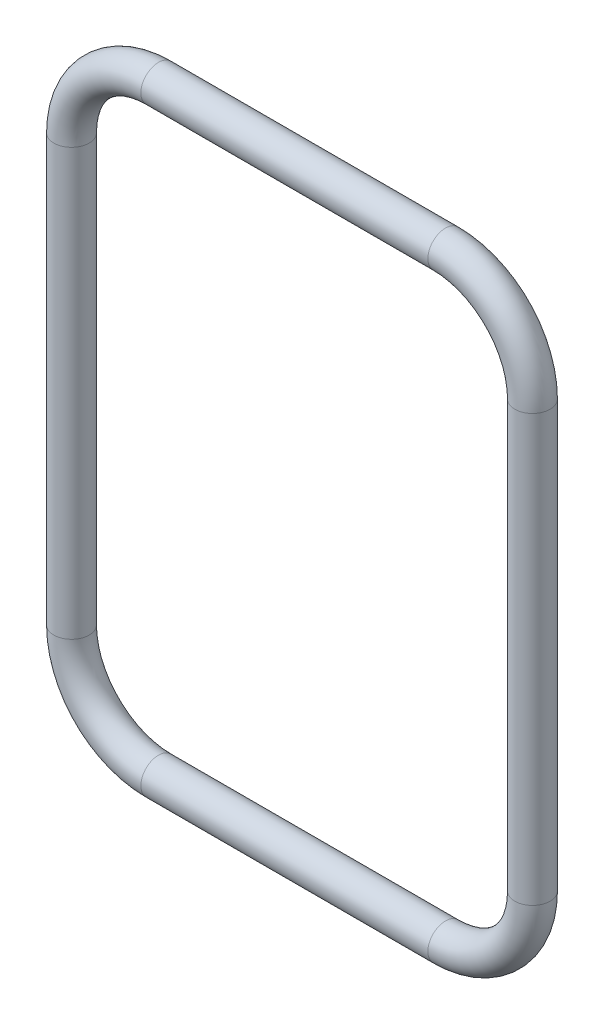
ISO-10303-21;
HEADER;
FILE_DESCRIPTION(('STEP AP214'),'2;1');
FILE_NAME('part.step','',(''),(''),'','','');
FILE_SCHEMA(('AUTOMOTIVE_DESIGN { 1 0 10303 214 1 1 1 1 }'));
ENDSEC;
DATA;
#1=APPLICATION_CONTEXT('core data for automotive mechanical design processes');
#2=APPLICATION_PROTOCOL_DEFINITION('international standard','automotive_design',2000,#1);
#3=PRODUCT_CONTEXT('',#1,'mechanical');
#4=PRODUCT('Part','Part','',(#3));
#5=PRODUCT_RELATED_PRODUCT_CATEGORY('part','',(#4));
#6=PRODUCT_DEFINITION_FORMATION('','',#4);
#7=PRODUCT_DEFINITION_CONTEXT('part definition',#1,'design');
#8=PRODUCT_DEFINITION('design','',#6,#7);
#9=PRODUCT_DEFINITION_SHAPE('','',#8);
#10=(LENGTH_UNIT() NAMED_UNIT(*) SI_UNIT(.MILLI.,.METRE.));
#11=(NAMED_UNIT(*) PLANE_ANGLE_UNIT() SI_UNIT($,.RADIAN.));
#12=(NAMED_UNIT(*) SI_UNIT($,.STERADIAN.) SOLID_ANGLE_UNIT());
#13=UNCERTAINTY_MEASURE_WITH_UNIT(LENGTH_MEASURE(1.E-05),#10,'distance_accuracy_value','');
#14=(GEOMETRIC_REPRESENTATION_CONTEXT(3) GLOBAL_UNCERTAINTY_ASSIGNED_CONTEXT((#13)) GLOBAL_UNIT_ASSIGNED_CONTEXT((#10,
#11,#12)) REPRESENTATION_CONTEXT('',''));
#15=CARTESIAN_POINT('',(0.,0.,0.));
#16=DIRECTION('',(0.,0.,1.));
#17=DIRECTION('',(1.,0.,0.));
#18=AXIS2_PLACEMENT_3D('',#15,#16,#17);
#19=CARTESIAN_POINT('',(0.577577747659383,-0.85737670420898,2.544934006666));
#20=DIRECTION('',(0.,0.,1.));
#21=DIRECTION('',(0.,-1.,0.));
#22=AXIS2_PLACEMENT_3D('',#19,#20,#21);
#23=TOROIDAL_SURFACE('',#22,0.35,0.071);
#24=CARTESIAN_POINT('',(0.927577747659383,-0.85737670420898,2.544934006666));
#25=DIRECTION('',(0.,1.,0.));
#26=DIRECTION('',(-1.,0.,0.));
#27=AXIS2_PLACEMENT_3D('',#24,#25,#26);
#28=CIRCLE('',#27,0.071);
#29=CARTESIAN_POINT('',(0.856577747659383,-0.85737670420898,2.544934006666));
#30=VERTEX_POINT('',#29);
#31=CARTESIAN_POINT('',(0.998577747659383,-0.85737670420898,2.544934006666));
#32=VERTEX_POINT('',#31);
#33=EDGE_CURVE('E11',#30,#32,#28,.T.);
#34=ORIENTED_EDGE('',*,*,#33,.F.);
#35=CARTESIAN_POINT('',(0.577577747659383,-0.85737670420898,2.544934006666));
#36=DIRECTION('',(0.,0.,-1.));
#37=DIRECTION('',(0.,-1.,0.));
#38=AXIS2_PLACEMENT_3D('',#35,#36,#37);
#39=CIRCLE('',#38,0.279);
#40=CARTESIAN_POINT('',(0.577577747659383,-1.136376704209,2.544934006666));
#41=VERTEX_POINT('',#40);
#42=EDGE_CURVE('E24',#30,#41,#39,.T.);
#43=ORIENTED_EDGE('',*,*,#42,.T.);
#44=CARTESIAN_POINT('',(0.577577747659383,-1.207376704209,2.544934006666));
#45=DIRECTION('',(1.,0.,0.));
#46=DIRECTION('',(0.,1.,0.));
#47=AXIS2_PLACEMENT_3D('',#44,#45,#46);
#48=CIRCLE('',#47,0.071);
#49=CARTESIAN_POINT('',(0.577577747659383,-1.278376704209,2.544934006666));
#50=VERTEX_POINT('',#49);
#51=EDGE_CURVE('E133',#41,#50,#48,.T.);
#52=ORIENTED_EDGE('',*,*,#51,.T.);
#53=CARTESIAN_POINT('',(0.577577747659383,-1.207376704209,2.544934006666));
#54=DIRECTION('',(1.,0.,0.));
#55=DIRECTION('',(0.,1.,0.));
#56=AXIS2_PLACEMENT_3D('',#53,#54,#55);
#57=CIRCLE('',#56,0.071);
#58=EDGE_CURVE('E130',#50,#41,#57,.T.);
#59=ORIENTED_EDGE('',*,*,#58,.T.);
#60=ORIENTED_EDGE('',*,*,#42,.F.);
#61=CARTESIAN_POINT('',(0.927577747659383,-0.85737670420898,2.544934006666));
#62=DIRECTION('',(0.,1.,0.));
#63=DIRECTION('',(-1.,0.,0.));
#64=AXIS2_PLACEMENT_3D('',#61,#62,#63);
#65=CIRCLE('',#64,0.071);
#66=EDGE_CURVE('E128',#32,#30,#65,.T.);
#67=ORIENTED_EDGE('',*,*,#66,.F.);
#68=EDGE_LOOP('',(#34,#43,#52,#59,#60,#67));
#69=FACE_BOUND('',#68,.T.);
#70=ADVANCED_FACE('F17',(#69),#23,.T.);
#71=CARTESIAN_POINT('',(-0.577577747659382,-1.207376704209,2.544934006666));
#72=DIRECTION('',(1.,0.,0.));
#73=DIRECTION('',(0.,1.,0.));
#74=AXIS2_PLACEMENT_3D('',#71,#72,#73);
#75=CYLINDRICAL_SURFACE('',#74,0.071);
#76=ORIENTED_EDGE('',*,*,#51,.F.);
#77=ORIENTED_EDGE('',*,*,#58,.F.);
#78=DIRECTION('',(-1.,0.,0.));
#79=VECTOR('',#78,1.);
#80=CARTESIAN_POINT('',(-0.577577747659382,-1.278376704209,2.544934006666));
#81=LINE('',#80,#79);
#82=CARTESIAN_POINT('',(-0.577577747659383,-1.278376704209,2.544934006666));
#83=VERTEX_POINT('',#82);
#84=EDGE_CURVE('E126',#50,#83,#81,.T.);
#85=ORIENTED_EDGE('',*,*,#84,.T.);
#86=CARTESIAN_POINT('',(-0.577577747659382,-1.207376704209,2.544934006666));
#87=DIRECTION('',(1.,0.,0.));
#88=DIRECTION('',(0.,1.,0.));
#89=AXIS2_PLACEMENT_3D('',#86,#87,#88);
#90=CIRCLE('',#89,0.071);
#91=CARTESIAN_POINT('',(-0.577577747659382,-1.136376704209,2.544934006666));
#92=VERTEX_POINT('',#91);
#93=EDGE_CURVE('E124',#83,#92,#90,.T.);
#94=ORIENTED_EDGE('',*,*,#93,.T.);
#95=CARTESIAN_POINT('',(-0.577577747659382,-1.207376704209,2.544934006666));
#96=DIRECTION('',(1.,0.,0.));
#97=DIRECTION('',(0.,1.,0.));
#98=AXIS2_PLACEMENT_3D('',#95,#96,#97);
#99=CIRCLE('',#98,0.071);
#100=EDGE_CURVE('E121',#92,#83,#99,.T.);
#101=ORIENTED_EDGE('',*,*,#100,.T.);
#102=ORIENTED_EDGE('',*,*,#84,.F.);
#103=EDGE_LOOP('',(#76,#77,#85,#94,#101,#102));
#104=FACE_BOUND('',#103,.T.);
#105=ADVANCED_FACE('F138',(#104),#75,.T.);
#106=CARTESIAN_POINT('',(-0.577577747659383,-0.857376704208981,2.544934006666));
#107=DIRECTION('',(0.,0.,1.));
#108=DIRECTION('',(1.,0.,0.));
#109=AXIS2_PLACEMENT_3D('',#106,#107,#108);
#110=TOROIDAL_SURFACE('',#109,0.35,0.071);
#111=ORIENTED_EDGE('',*,*,#100,.F.);
#112=CARTESIAN_POINT('',(-0.577577747659383,-0.857376704208981,2.544934006666));
#113=DIRECTION('',(0.,0.,-1.));
#114=DIRECTION('',(1.,0.,0.));
#115=AXIS2_PLACEMENT_3D('',#112,#113,#114);
#116=CIRCLE('',#115,0.279);
#117=CARTESIAN_POINT('',(-0.856577747659383,-0.857376704208981,2.544934006666));
#118=VERTEX_POINT('',#117);
#119=EDGE_CURVE('E119',#92,#118,#116,.T.);
#120=ORIENTED_EDGE('',*,*,#119,.T.);
#121=CARTESIAN_POINT('',(-0.927577747659382,-0.857376704208981,2.544934006666));
#122=DIRECTION('',(0.,-1.,0.));
#123=DIRECTION('',(1.,0.,0.));
#124=AXIS2_PLACEMENT_3D('',#121,#122,#123);
#125=CIRCLE('',#124,0.071);
#126=CARTESIAN_POINT('',(-0.998577747659382,-0.857376704208981,2.544934006666));
#127=VERTEX_POINT('',#126);
#128=EDGE_CURVE('E117',#118,#127,#125,.T.);
#129=ORIENTED_EDGE('',*,*,#128,.T.);
#130=CARTESIAN_POINT('',(-0.927577747659382,-0.857376704208981,2.544934006666));
#131=DIRECTION('',(0.,-1.,0.));
#132=DIRECTION('',(1.,0.,0.));
#133=AXIS2_PLACEMENT_3D('',#130,#131,#132);
#134=CIRCLE('',#133,0.071);
#135=EDGE_CURVE('E114',#127,#118,#134,.T.);
#136=ORIENTED_EDGE('',*,*,#135,.T.);
#137=ORIENTED_EDGE('',*,*,#119,.F.);
#138=ORIENTED_EDGE('',*,*,#93,.F.);
#139=EDGE_LOOP('',(#111,#120,#129,#136,#137,#138));
#140=FACE_BOUND('',#139,.T.);
#141=ADVANCED_FACE('F143',(#140),#110,.T.);
#142=CARTESIAN_POINT('',(-0.927577747659382,0.857376704208981,2.544934006666));
#143=DIRECTION('',(0.,-1.,0.));
#144=DIRECTION('',(1.,0.,0.));
#145=AXIS2_PLACEMENT_3D('',#142,#143,#144);
#146=CYLINDRICAL_SURFACE('',#145,0.071);
#147=ORIENTED_EDGE('',*,*,#128,.F.);
#148=ORIENTED_EDGE('',*,*,#135,.F.);
#149=DIRECTION('',(0.,1.,0.));
#150=VECTOR('',#149,1.);
#151=CARTESIAN_POINT('',(-0.998577747659382,0.857376704208981,2.544934006666));
#152=LINE('',#151,#150);
#153=CARTESIAN_POINT('',(-0.998577747659382,0.857376704208981,2.544934006666));
#154=VERTEX_POINT('',#153);
#155=EDGE_CURVE('E112',#127,#154,#152,.T.);
#156=ORIENTED_EDGE('',*,*,#155,.T.);
#157=CARTESIAN_POINT('',(-0.927577747659382,0.857376704208981,2.544934006666));
#158=DIRECTION('',(0.,-1.,0.));
#159=DIRECTION('',(1.,0.,0.));
#160=AXIS2_PLACEMENT_3D('',#157,#158,#159);
#161=CIRCLE('',#160,0.071);
#162=CARTESIAN_POINT('',(-0.856577747659383,0.857376704208981,2.544934006666));
#163=VERTEX_POINT('',#162);
#164=EDGE_CURVE('E110',#154,#163,#161,.T.);
#165=ORIENTED_EDGE('',*,*,#164,.T.);
#166=CARTESIAN_POINT('',(-0.927577747659382,0.857376704208981,2.544934006666));
#167=DIRECTION('',(0.,-1.,0.));
#168=DIRECTION('',(1.,0.,0.));
#169=AXIS2_PLACEMENT_3D('',#166,#167,#168);
#170=CIRCLE('',#169,0.071);
#171=EDGE_CURVE('E107',#163,#154,#170,.T.);
#172=ORIENTED_EDGE('',*,*,#171,.T.);
#173=ORIENTED_EDGE('',*,*,#155,.F.);
#174=EDGE_LOOP('',(#147,#148,#156,#165,#172,#173));
#175=FACE_BOUND('',#174,.T.);
#176=ADVANCED_FACE('F148',(#175),#146,.T.);
#177=CARTESIAN_POINT('',(-0.577577747659383,0.857376704208981,2.544934006666));
#178=DIRECTION('',(0.,0.,1.));
#179=DIRECTION('',(1.,0.,0.));
#180=AXIS2_PLACEMENT_3D('',#177,#178,#179);
#181=TOROIDAL_SURFACE('',#180,0.35,0.071);
#182=ORIENTED_EDGE('',*,*,#171,.F.);
#183=CARTESIAN_POINT('',(-0.577577747659383,0.857376704208981,2.544934006666));
#184=DIRECTION('',(0.,0.,-1.));
#185=DIRECTION('',(1.,0.,0.));
#186=AXIS2_PLACEMENT_3D('',#183,#184,#185);
#187=CIRCLE('',#186,0.279);
#188=CARTESIAN_POINT('',(-0.577577747659383,1.136376704209,2.544934006666));
#189=VERTEX_POINT('',#188);
#190=EDGE_CURVE('E105',#163,#189,#187,.T.);
#191=ORIENTED_EDGE('',*,*,#190,.T.);
#192=CARTESIAN_POINT('',(-0.577577747659383,1.207376704209,2.544934006666));
#193=DIRECTION('',(-1.,0.,0.));
#194=DIRECTION('',(0.,-1.,0.));
#195=AXIS2_PLACEMENT_3D('',#192,#193,#194);
#196=CIRCLE('',#195,0.071);
#197=CARTESIAN_POINT('',(-0.577577747659383,1.278376704209,2.544934006666));
#198=VERTEX_POINT('',#197);
#199=EDGE_CURVE('E103',#189,#198,#196,.T.);
#200=ORIENTED_EDGE('',*,*,#199,.T.);
#201=CARTESIAN_POINT('',(-0.577577747659383,1.207376704209,2.544934006666));
#202=DIRECTION('',(-1.,0.,0.));
#203=DIRECTION('',(0.,-1.,0.));
#204=AXIS2_PLACEMENT_3D('',#201,#202,#203);
#205=CIRCLE('',#204,0.071);
#206=EDGE_CURVE('E100',#198,#189,#205,.T.);
#207=ORIENTED_EDGE('',*,*,#206,.T.);
#208=ORIENTED_EDGE('',*,*,#190,.F.);
#209=ORIENTED_EDGE('',*,*,#164,.F.);
#210=EDGE_LOOP('',(#182,#191,#200,#207,#208,#209));
#211=FACE_BOUND('',#210,.T.);
#212=ADVANCED_FACE('F153',(#211),#181,.T.);
#213=CARTESIAN_POINT('',(0.577577747659383,1.207376704209,2.544934006666));
#214=DIRECTION('',(-1.,0.,0.));
#215=DIRECTION('',(0.,-1.,0.));
#216=AXIS2_PLACEMENT_3D('',#213,#214,#215);
#217=CYLINDRICAL_SURFACE('',#216,0.071);
#218=ORIENTED_EDGE('',*,*,#199,.F.);
#219=ORIENTED_EDGE('',*,*,#206,.F.);
#220=DIRECTION('',(1.,0.,0.));
#221=VECTOR('',#220,1.);
#222=CARTESIAN_POINT('',(0.577577747659383,1.278376704209,2.544934006666));
#223=LINE('',#222,#221);
#224=CARTESIAN_POINT('',(0.577577747659383,1.278376704209,2.544934006666));
#225=VERTEX_POINT('',#224);
#226=EDGE_CURVE('E98',#198,#225,#223,.T.);
#227=ORIENTED_EDGE('',*,*,#226,.T.);
#228=CARTESIAN_POINT('',(0.577577747659383,1.207376704209,2.544934006666));
#229=DIRECTION('',(-1.,0.,0.));
#230=DIRECTION('',(0.,-1.,0.));
#231=AXIS2_PLACEMENT_3D('',#228,#229,#230);
#232=CIRCLE('',#231,0.071);
#233=CARTESIAN_POINT('',(0.577577747659383,1.136376704209,2.544934006666));
#234=VERTEX_POINT('',#233);
#235=EDGE_CURVE('E96',#225,#234,#232,.T.);
#236=ORIENTED_EDGE('',*,*,#235,.T.);
#237=CARTESIAN_POINT('',(0.577577747659383,1.207376704209,2.544934006666));
#238=DIRECTION('',(-1.,0.,0.));
#239=DIRECTION('',(0.,-1.,0.));
#240=AXIS2_PLACEMENT_3D('',#237,#238,#239);
#241=CIRCLE('',#240,0.071);
#242=EDGE_CURVE('E93',#234,#225,#241,.T.);
#243=ORIENTED_EDGE('',*,*,#242,.T.);
#244=ORIENTED_EDGE('',*,*,#226,.F.);
#245=EDGE_LOOP('',(#218,#219,#227,#236,#243,#244));
#246=FACE_BOUND('',#245,.T.);
#247=ADVANCED_FACE('F158',(#246),#217,.T.);
#248=CARTESIAN_POINT('',(0.577577747659383,0.857376704208981,2.544934006666));
#249=DIRECTION('',(0.,0.,1.));
#250=DIRECTION('',(1.,0.,0.));
#251=AXIS2_PLACEMENT_3D('',#248,#249,#250);
#252=TOROIDAL_SURFACE('',#251,0.35,0.071);
#253=ORIENTED_EDGE('',*,*,#242,.F.);
#254=CARTESIAN_POINT('',(0.577577747659383,0.857376704208981,2.544934006666));
#255=DIRECTION('',(0.,0.,-1.));
#256=DIRECTION('',(1.,0.,0.));
#257=AXIS2_PLACEMENT_3D('',#254,#255,#256);
#258=CIRCLE('',#257,0.279);
#259=CARTESIAN_POINT('',(0.856577747659383,0.857376704208981,2.544934006666));
#260=VERTEX_POINT('',#259);
#261=EDGE_CURVE('E84',#234,#260,#258,.T.);
#262=ORIENTED_EDGE('',*,*,#261,.T.);
#263=CARTESIAN_POINT('',(0.927577747659383,0.857376704208981,2.544934006666));
#264=DIRECTION('',(0.,1.,0.));
#265=DIRECTION('',(-1.,0.,0.));
#266=AXIS2_PLACEMENT_3D('',#263,#264,#265);
#267=CIRCLE('',#266,0.071);
#268=CARTESIAN_POINT('',(0.998577747659383,0.857376704208981,2.544934006666));
#269=VERTEX_POINT('',#268);
#270=EDGE_CURVE('E78',#260,#269,#267,.T.);
#271=ORIENTED_EDGE('',*,*,#270,.T.);
#272=CARTESIAN_POINT('',(0.927577747659383,0.857376704208981,2.544934006666));
#273=DIRECTION('',(0.,1.,0.));
#274=DIRECTION('',(-1.,0.,0.));
#275=AXIS2_PLACEMENT_3D('',#272,#273,#274);
#276=CIRCLE('',#275,0.071);
#277=EDGE_CURVE('E83',#269,#260,#276,.T.);
#278=ORIENTED_EDGE('',*,*,#277,.T.);
#279=ORIENTED_EDGE('',*,*,#261,.F.);
#280=ORIENTED_EDGE('',*,*,#235,.F.);
#281=EDGE_LOOP('',(#253,#262,#271,#278,#279,#280));
#282=FACE_BOUND('',#281,.T.);
#283=ADVANCED_FACE('F81',(#282),#252,.T.);
#284=CARTESIAN_POINT('',(0.927577747659383,-0.85737670420898,2.544934006666));
#285=DIRECTION('',(0.,1.,0.));
#286=DIRECTION('',(-1.,0.,0.));
#287=AXIS2_PLACEMENT_3D('',#284,#285,#286);
#288=CYLINDRICAL_SURFACE('',#287,0.071);
#289=ORIENTED_EDGE('',*,*,#270,.F.);
#290=ORIENTED_EDGE('',*,*,#277,.F.);
#291=DIRECTION('',(0.,-1.,0.));
#292=VECTOR('',#291,1.);
#293=CARTESIAN_POINT('',(0.998577747659383,-0.85737670420898,2.544934006666));
#294=LINE('',#293,#292);
#295=EDGE_CURVE('E88',#269,#32,#294,.T.);
#296=ORIENTED_EDGE('',*,*,#295,.T.);
#297=ORIENTED_EDGE('',*,*,#66,.T.);
#298=ORIENTED_EDGE('',*,*,#33,.T.);
#299=ORIENTED_EDGE('',*,*,#295,.F.);
#300=EDGE_LOOP('',(#289,#290,#296,#297,#298,#299));
#301=FACE_BOUND('',#300,.T.);
#302=ADVANCED_FACE('F87',(#301),#288,.T.);
#303=CLOSED_SHELL('',(#70,#105,#141,#176,#212,#247,#283,#302));
#304=MANIFOLD_SOLID_BREP('B1',#303);
#305=ADVANCED_BREP_SHAPE_REPRESENTATION('',(#18,#304),#14);
#306=SHAPE_DEFINITION_REPRESENTATION(#9,#305);
ENDSEC;
END-ISO-10303-21;
